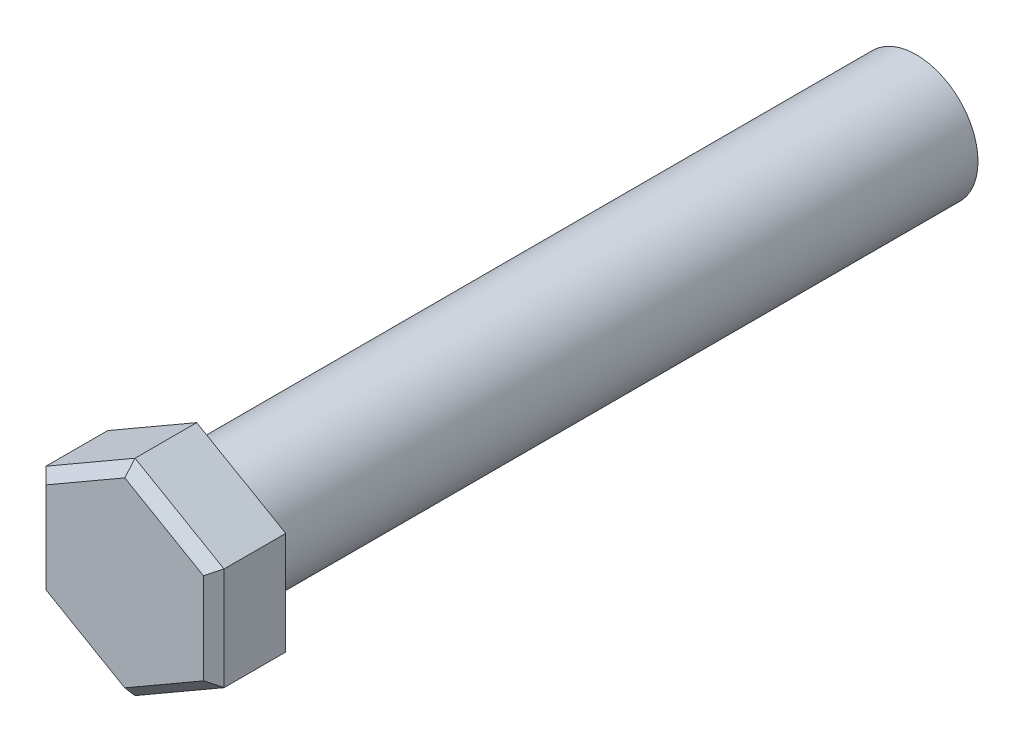
ISO-10303-21;
HEADER;
FILE_DESCRIPTION(('STEP AP214'),'2;1');
FILE_NAME('part.step','',(''),(''),'','','');
FILE_SCHEMA(('AUTOMOTIVE_DESIGN { 1 0 10303 214 1 1 1 1 }'));
ENDSEC;
DATA;
#1=APPLICATION_CONTEXT('core data for automotive mechanical design processes');
#2=APPLICATION_PROTOCOL_DEFINITION('international standard','automotive_design',2000,#1);
#3=PRODUCT_CONTEXT('',#1,'mechanical');
#4=PRODUCT('Part','Part','',(#3));
#5=PRODUCT_RELATED_PRODUCT_CATEGORY('part','',(#4));
#6=PRODUCT_DEFINITION_FORMATION('','',#4);
#7=PRODUCT_DEFINITION_CONTEXT('part definition',#1,'design');
#8=PRODUCT_DEFINITION('design','',#6,#7);
#9=PRODUCT_DEFINITION_SHAPE('','',#8);
#10=(LENGTH_UNIT() NAMED_UNIT(*) SI_UNIT(.MILLI.,.METRE.));
#11=(NAMED_UNIT(*) PLANE_ANGLE_UNIT() SI_UNIT($,.RADIAN.));
#12=(NAMED_UNIT(*) SI_UNIT($,.STERADIAN.) SOLID_ANGLE_UNIT());
#13=UNCERTAINTY_MEASURE_WITH_UNIT(LENGTH_MEASURE(1.E-05),#10,'distance_accuracy_value','');
#14=(GEOMETRIC_REPRESENTATION_CONTEXT(3) GLOBAL_UNCERTAINTY_ASSIGNED_CONTEXT((#13)) GLOBAL_UNIT_ASSIGNED_CONTEXT((#10,
#11,#12)) REPRESENTATION_CONTEXT('',''));
#15=CARTESIAN_POINT('',(0.,0.,0.));
#16=DIRECTION('',(0.,0.,1.));
#17=DIRECTION('',(1.,0.,0.));
#18=AXIS2_PLACEMENT_3D('',#15,#16,#17);
#19=CARTESIAN_POINT('',(0.,0.,70.));
#20=DIRECTION('',(0.,0.,-1.));
#21=DIRECTION('',(-1.,0.,0.));
#22=AXIS2_PLACEMENT_3D('',#19,#20,#21);
#23=CYLINDRICAL_SURFACE('',#22,6.);
#24=CARTESIAN_POINT('',(0.,0.,69.));
#25=DIRECTION('',(0.,0.,1.));
#26=DIRECTION('',(1.,0.,0.));
#27=AXIS2_PLACEMENT_3D('',#24,#25,#26);
#28=CIRCLE('',#27,6.);
#29=CARTESIAN_POINT('',(6.,0.,69.));
#30=VERTEX_POINT('',#29);
#31=EDGE_CURVE('E11',#30,#30,#28,.F.);
#32=ORIENTED_EDGE('',*,*,#31,.T.);
#33=EDGE_LOOP('',(#32));
#34=FACE_BOUND('',#33,.T.);
#35=CARTESIAN_POINT('',(0.,0.,0.));
#36=DIRECTION('',(0.,0.,1.));
#37=DIRECTION('',(1.,0.,0.));
#38=AXIS2_PLACEMENT_3D('',#35,#36,#37);
#39=CIRCLE('',#38,6.);
#40=CARTESIAN_POINT('',(6.,0.,0.));
#41=VERTEX_POINT('',#40);
#42=EDGE_CURVE('E128',#41,#41,#39,.T.);
#43=ORIENTED_EDGE('',*,*,#42,.T.);
#44=EDGE_LOOP('',(#43));
#45=FACE_BOUND('',#44,.T.);
#46=ADVANCED_FACE('F43',(#34,#45),#23,.T.);
#47=CARTESIAN_POINT('',(0.,0.,0.));
#48=DIRECTION('',(0.,0.,1.));
#49=DIRECTION('',(1.,0.,0.));
#50=AXIS2_PLACEMENT_3D('',#47,#48,#49);
#51=PLANE('',#50);
#52=ORIENTED_EDGE('',*,*,#42,.F.);
#53=EDGE_LOOP('',(#52));
#54=FACE_BOUND('',#53,.T.);
#55=ADVANCED_FACE('F248',(#54),#51,.F.);
#56=CARTESIAN_POINT('',(8.66025403784437,0.,77.));
#57=DIRECTION('',(-1.,0.,0.));
#58=DIRECTION('',(0.,-1.,0.));
#59=AXIS2_PLACEMENT_3D('',#56,#57,#58);
#60=PLANE('',#59);
#61=DIRECTION('',(0.,0.,-1.));
#62=VECTOR('',#61,1.);
#63=CARTESIAN_POINT('',(8.66025403784436,5.00000000000004,77.));
#64=LINE('',#63,#62);
#65=CARTESIAN_POINT('',(8.66025403784436,5.00000000000004,76.));
#66=VERTEX_POINT('',#65);
#67=CARTESIAN_POINT('',(8.66025403784436,5.00000000000004,70.));
#68=VERTEX_POINT('',#67);
#69=EDGE_CURVE('E116',#66,#68,#64,.T.);
#70=ORIENTED_EDGE('',*,*,#69,.F.);
#71=DIRECTION('',(0.,-1.,0.));
#72=VECTOR('',#71,1.);
#73=CARTESIAN_POINT('',(8.66025403784438,-5.00000000000001,76.));
#74=LINE('',#73,#72);
#75=CARTESIAN_POINT('',(8.66025403784438,-5.00000000000001,76.));
#76=VERTEX_POINT('',#75);
#77=EDGE_CURVE('E201',#66,#76,#74,.T.);
#78=ORIENTED_EDGE('',*,*,#77,.T.);
#79=DIRECTION('',(0.,0.,-1.));
#80=VECTOR('',#79,1.);
#81=CARTESIAN_POINT('',(8.66025403784438,-5.00000000000001,77.));
#82=LINE('',#81,#80);
#83=CARTESIAN_POINT('',(8.66025403784438,-5.00000000000001,70.));
#84=VERTEX_POINT('',#83);
#85=EDGE_CURVE('E143',#76,#84,#82,.T.);
#86=ORIENTED_EDGE('',*,*,#85,.T.);
#87=DIRECTION('',(0.,1.,0.));
#88=VECTOR('',#87,1.);
#89=CARTESIAN_POINT('',(8.66025403784437,0.,70.));
#90=LINE('',#89,#88);
#91=EDGE_CURVE('E135',#84,#68,#90,.T.);
#92=ORIENTED_EDGE('',*,*,#91,.T.);
#93=EDGE_LOOP('',(#70,#78,#86,#92));
#94=FACE_BOUND('',#93,.T.);
#95=ADVANCED_FACE('F141',(#94),#60,.F.);
#96=CARTESIAN_POINT('',(4.33012701892218,7.50000000000002,77.));
#97=DIRECTION('',(-0.499999999999998,-0.86602540378444,0.));
#98=DIRECTION('',(0.86602540378444,-0.499999999999998,0.));
#99=AXIS2_PLACEMENT_3D('',#96,#97,#98);
#100=PLANE('',#99);
#101=DIRECTION('',(0.,0.,-1.));
#102=VECTOR('',#101,1.);
#103=CARTESIAN_POINT('',(0.,10.,77.));
#104=LINE('',#103,#102);
#105=CARTESIAN_POINT('',(0.,10.,76.));
#106=VERTEX_POINT('',#105);
#107=CARTESIAN_POINT('',(0.,10.,70.));
#108=VERTEX_POINT('',#107);
#109=EDGE_CURVE('E129',#106,#108,#104,.T.);
#110=ORIENTED_EDGE('',*,*,#109,.F.);
#111=DIRECTION('',(0.86602540378444,-0.499999999999998,0.));
#112=VECTOR('',#111,1.);
#113=CARTESIAN_POINT('',(8.66025403784436,5.00000000000004,76.));
#114=LINE('',#113,#112);
#115=EDGE_CURVE('E122',#106,#66,#114,.T.);
#116=ORIENTED_EDGE('',*,*,#115,.T.);
#117=ORIENTED_EDGE('',*,*,#69,.T.);
#118=DIRECTION('',(-0.86602540378444,0.499999999999998,0.));
#119=VECTOR('',#118,1.);
#120=CARTESIAN_POINT('',(4.33012701892218,7.50000000000002,70.));
#121=LINE('',#120,#119);
#122=EDGE_CURVE('E119',#68,#108,#121,.T.);
#123=ORIENTED_EDGE('',*,*,#122,.T.);
#124=EDGE_LOOP('',(#110,#116,#117,#123));
#125=FACE_BOUND('',#124,.T.);
#126=ADVANCED_FACE('F118',(#125),#100,.F.);
#127=CARTESIAN_POINT('',(-4.33012701892218,7.50000000000002,77.));
#128=DIRECTION('',(0.499999999999998,-0.86602540378444,0.));
#129=DIRECTION('',(0.86602540378444,0.499999999999998,0.));
#130=AXIS2_PLACEMENT_3D('',#127,#128,#129);
#131=PLANE('',#130);
#132=DIRECTION('',(0.,0.,-1.));
#133=VECTOR('',#132,1.);
#134=CARTESIAN_POINT('',(-8.66025403784437,5.00000000000004,77.));
#135=LINE('',#134,#133);
#136=CARTESIAN_POINT('',(-8.66025403784437,5.00000000000004,76.));
#137=VERTEX_POINT('',#136);
#138=CARTESIAN_POINT('',(-8.66025403784437,5.00000000000004,70.));
#139=VERTEX_POINT('',#138);
#140=EDGE_CURVE('E174',#137,#139,#135,.T.);
#141=ORIENTED_EDGE('',*,*,#140,.F.);
#142=DIRECTION('',(0.86602540378444,0.499999999999998,0.));
#143=VECTOR('',#142,1.);
#144=CARTESIAN_POINT('',(0.,10.,76.));
#145=LINE('',#144,#143);
#146=EDGE_CURVE('E59',#137,#106,#145,.T.);
#147=ORIENTED_EDGE('',*,*,#146,.T.);
#148=ORIENTED_EDGE('',*,*,#109,.T.);
#149=DIRECTION('',(-0.86602540378444,-0.499999999999998,0.));
#150=VECTOR('',#149,1.);
#151=CARTESIAN_POINT('',(-4.33012701892218,7.50000000000002,70.));
#152=LINE('',#151,#150);
#153=EDGE_CURVE('E138',#108,#139,#152,.T.);
#154=ORIENTED_EDGE('',*,*,#153,.T.);
#155=EDGE_LOOP('',(#141,#147,#148,#154));
#156=FACE_BOUND('',#155,.T.);
#157=ADVANCED_FACE('F317',(#156),#131,.F.);
#158=CARTESIAN_POINT('',(-8.66025403784436,0.,77.));
#159=DIRECTION('',(1.,0.,0.));
#160=DIRECTION('',(0.,1.,0.));
#161=AXIS2_PLACEMENT_3D('',#158,#159,#160);
#162=PLANE('',#161);
#163=DIRECTION('',(0.,0.,-1.));
#164=VECTOR('',#163,1.);
#165=CARTESIAN_POINT('',(-8.66025403784436,-5.00000000000004,77.));
#166=LINE('',#165,#164);
#167=CARTESIAN_POINT('',(-8.66025403784436,-5.00000000000004,76.));
#168=VERTEX_POINT('',#167);
#169=CARTESIAN_POINT('',(-8.66025403784436,-5.00000000000004,70.));
#170=VERTEX_POINT('',#169);
#171=EDGE_CURVE('E171',#168,#170,#166,.T.);
#172=ORIENTED_EDGE('',*,*,#171,.F.);
#173=DIRECTION('',(0.,1.,0.));
#174=VECTOR('',#173,1.);
#175=CARTESIAN_POINT('',(-8.66025403784437,5.00000000000004,76.));
#176=LINE('',#175,#174);
#177=EDGE_CURVE('E67',#168,#137,#176,.T.);
#178=ORIENTED_EDGE('',*,*,#177,.T.);
#179=ORIENTED_EDGE('',*,*,#140,.T.);
#180=DIRECTION('',(0.,-1.,0.));
#181=VECTOR('',#180,1.);
#182=CARTESIAN_POINT('',(-8.66025403784436,0.,70.));
#183=LINE('',#182,#181);
#184=EDGE_CURVE('E155',#139,#170,#183,.T.);
#185=ORIENTED_EDGE('',*,*,#184,.T.);
#186=EDGE_LOOP('',(#172,#178,#179,#185));
#187=FACE_BOUND('',#186,.T.);
#188=ADVANCED_FACE('F316',(#187),#162,.F.);
#189=CARTESIAN_POINT('',(-4.33012701892218,-7.50000000000002,77.));
#190=DIRECTION('',(0.499999999999998,0.86602540378444,0.));
#191=DIRECTION('',(-0.86602540378444,0.499999999999998,0.));
#192=AXIS2_PLACEMENT_3D('',#189,#190,#191);
#193=PLANE('',#192);
#194=DIRECTION('',(0.,0.,-1.));
#195=VECTOR('',#194,1.);
#196=CARTESIAN_POINT('',(0.,-10.,77.));
#197=LINE('',#196,#195);
#198=CARTESIAN_POINT('',(0.,-10.,76.));
#199=VERTEX_POINT('',#198);
#200=CARTESIAN_POINT('',(0.,-10.,70.));
#201=VERTEX_POINT('',#200);
#202=EDGE_CURVE('E168',#199,#201,#197,.T.);
#203=ORIENTED_EDGE('',*,*,#202,.F.);
#204=DIRECTION('',(-0.86602540378444,0.499999999999998,0.));
#205=VECTOR('',#204,1.);
#206=CARTESIAN_POINT('',(-8.66025403784436,-5.00000000000004,76.));
#207=LINE('',#206,#205);
#208=EDGE_CURVE('E207',#199,#168,#207,.T.);
#209=ORIENTED_EDGE('',*,*,#208,.T.);
#210=ORIENTED_EDGE('',*,*,#171,.T.);
#211=DIRECTION('',(0.86602540378444,-0.499999999999998,0.));
#212=VECTOR('',#211,1.);
#213=CARTESIAN_POINT('',(-4.33012701892218,-7.50000000000002,70.));
#214=LINE('',#213,#212);
#215=EDGE_CURVE('E159',#170,#201,#214,.T.);
#216=ORIENTED_EDGE('',*,*,#215,.T.);
#217=EDGE_LOOP('',(#203,#209,#210,#216));
#218=FACE_BOUND('',#217,.T.);
#219=ADVANCED_FACE('F314',(#218),#193,.F.);
#220=CARTESIAN_POINT('',(4.33012701892219,-7.50000000000001,77.));
#221=DIRECTION('',(-0.5,0.866025403784439,0.));
#222=DIRECTION('',(-0.866025403784439,-0.5,0.));
#223=AXIS2_PLACEMENT_3D('',#220,#221,#222);
#224=PLANE('',#223);
#225=ORIENTED_EDGE('',*,*,#85,.F.);
#226=DIRECTION('',(-0.866025403784439,-0.5,0.));
#227=VECTOR('',#226,1.);
#228=CARTESIAN_POINT('',(0.,-10.,76.));
#229=LINE('',#228,#227);
#230=EDGE_CURVE('E204',#76,#199,#229,.T.);
#231=ORIENTED_EDGE('',*,*,#230,.T.);
#232=ORIENTED_EDGE('',*,*,#202,.T.);
#233=DIRECTION('',(0.866025403784439,0.5,0.));
#234=VECTOR('',#233,1.);
#235=CARTESIAN_POINT('',(4.33012701892219,-7.50000000000001,70.));
#236=LINE('',#235,#234);
#237=EDGE_CURVE('E163',#201,#84,#236,.T.);
#238=ORIENTED_EDGE('',*,*,#237,.T.);
#239=EDGE_LOOP('',(#225,#231,#232,#238));
#240=FACE_BOUND('',#239,.T.);
#241=ADVANCED_FACE('F310',(#240),#224,.F.);
#242=CARTESIAN_POINT('',(0.,0.,77.));
#243=DIRECTION('',(0.,0.,1.));
#244=DIRECTION('',(1.,0.,0.));
#245=AXIS2_PLACEMENT_3D('',#242,#243,#244);
#246=PLANE('',#245);
#247=DIRECTION('',(0.866025403784439,0.5,0.));
#248=VECTOR('',#247,1.);
#249=CARTESIAN_POINT('',(8.16025403784437,-4.13397459621556,77.));
#250=LINE('',#249,#248);
#251=CARTESIAN_POINT('',(0.,-8.84529946162074,77.));
#252=VERTEX_POINT('',#251);
#253=CARTESIAN_POINT('',(7.66025403784437,-4.42264973081038,77.));
#254=VERTEX_POINT('',#253);
#255=EDGE_CURVE('E194',#252,#254,#250,.T.);
#256=ORIENTED_EDGE('',*,*,#255,.T.);
#257=DIRECTION('',(0.,1.,0.));
#258=VECTOR('',#257,1.);
#259=CARTESIAN_POINT('',(7.66025403784435,5.00000000000004,77.));
#260=LINE('',#259,#258);
#261=CARTESIAN_POINT('',(7.66025403784435,4.42264973081041,77.));
#262=VERTEX_POINT('',#261);
#263=EDGE_CURVE('E197',#254,#262,#260,.T.);
#264=ORIENTED_EDGE('',*,*,#263,.T.);
#265=DIRECTION('',(-0.86602540378444,0.499999999999998,0.));
#266=VECTOR('',#265,1.);
#267=CARTESIAN_POINT('',(-0.500000000000004,9.13397459621555,77.));
#268=LINE('',#267,#266);
#269=CARTESIAN_POINT('',(0.,8.84529946162074,77.));
#270=VERTEX_POINT('',#269);
#271=EDGE_CURVE('E182',#262,#270,#268,.T.);
#272=ORIENTED_EDGE('',*,*,#271,.T.);
#273=DIRECTION('',(-0.86602540378444,-0.499999999999998,0.));
#274=VECTOR('',#273,1.);
#275=CARTESIAN_POINT('',(-8.16025403784436,4.13397459621559,77.));
#276=LINE('',#275,#274);
#277=CARTESIAN_POINT('',(-7.66025403784435,4.42264973081041,77.));
#278=VERTEX_POINT('',#277);
#279=EDGE_CURVE('E185',#270,#278,#276,.T.);
#280=ORIENTED_EDGE('',*,*,#279,.T.);
#281=DIRECTION('',(0.,-1.,0.));
#282=VECTOR('',#281,1.);
#283=CARTESIAN_POINT('',(-7.66025403784435,-5.00000000000004,77.));
#284=LINE('',#283,#282);
#285=CARTESIAN_POINT('',(-7.66025403784435,-4.4226497308104,77.));
#286=VERTEX_POINT('',#285);
#287=EDGE_CURVE('E188',#278,#286,#284,.T.);
#288=ORIENTED_EDGE('',*,*,#287,.T.);
#289=DIRECTION('',(0.86602540378444,-0.499999999999998,0.));
#290=VECTOR('',#289,1.);
#291=CARTESIAN_POINT('',(0.500000000000004,-9.13397459621555,77.));
#292=LINE('',#291,#290);
#293=EDGE_CURVE('E191',#286,#252,#292,.T.);
#294=ORIENTED_EDGE('',*,*,#293,.T.);
#295=EDGE_LOOP('',(#256,#264,#272,#280,#288,#294));
#296=FACE_BOUND('',#295,.T.);
#297=ADVANCED_FACE('F297',(#296),#246,.T.);
#298=CARTESIAN_POINT('',(0.,0.,70.));
#299=DIRECTION('',(0.,0.,1.));
#300=DIRECTION('',(1.,0.,0.));
#301=AXIS2_PLACEMENT_3D('',#298,#299,#300);
#302=PLANE('',#301);
#303=CARTESIAN_POINT('',(0.,0.,70.));
#304=DIRECTION('',(0.,0.,1.));
#305=DIRECTION('',(1.,0.,0.));
#306=AXIS2_PLACEMENT_3D('',#303,#304,#305);
#307=CIRCLE('',#306,7.);
#308=CARTESIAN_POINT('',(7.,0.,70.));
#309=VERTEX_POINT('',#308);
#310=EDGE_CURVE('E52',#309,#309,#307,.T.);
#311=ORIENTED_EDGE('',*,*,#310,.T.);
#312=EDGE_LOOP('',(#311));
#313=FACE_BOUND('',#312,.T.);
#314=ORIENTED_EDGE('',*,*,#91,.F.);
#315=ORIENTED_EDGE('',*,*,#237,.F.);
#316=ORIENTED_EDGE('',*,*,#215,.F.);
#317=ORIENTED_EDGE('',*,*,#184,.F.);
#318=ORIENTED_EDGE('',*,*,#153,.F.);
#319=ORIENTED_EDGE('',*,*,#122,.F.);
#320=EDGE_LOOP('',(#314,#315,#316,#317,#318,#319));
#321=FACE_BOUND('',#320,.T.);
#322=ADVANCED_FACE('F133',(#313,#321),#302,.F.);
#323=CARTESIAN_POINT('',(-7.66025403784435,0.,77.));
#324=DIRECTION('',(-0.707106781186554,0.,0.707106781186541));
#325=DIRECTION('',(0.,1.,0.));
#326=AXIS2_PLACEMENT_3D('',#323,#324,#325);
#327=PLANE('',#326);
#328=DIRECTION('',(0.654653670707972,-0.377964473009226,0.654653670707983));
#329=VECTOR('',#328,1.);
#330=CARTESIAN_POINT('',(-6.56593203243803,3.79084262640894,78.0943220054064));
#331=LINE('',#330,#329);
#332=EDGE_CURVE('E150',#137,#278,#331,.T.);
#333=ORIENTED_EDGE('',*,*,#332,.F.);
#334=ORIENTED_EDGE('',*,*,#177,.F.);
#335=DIRECTION('',(0.654653670707972,0.377964473009225,0.654653670707984));
#336=VECTOR('',#335,1.);
#337=CARTESIAN_POINT('',(-6.56593203243802,-3.79084262640893,78.0943220054064));
#338=LINE('',#337,#336);
#339=EDGE_CURVE('E146',#286,#168,#338,.F.);
#340=ORIENTED_EDGE('',*,*,#339,.F.);
#341=ORIENTED_EDGE('',*,*,#287,.F.);
#342=EDGE_LOOP('',(#333,#334,#340,#341));
#343=FACE_BOUND('',#342,.T.);
#344=ADVANCED_FACE('F288',(#343),#327,.T.);
#345=CARTESIAN_POINT('',(-3.83012701892218,-6.63397459621557,77.));
#346=DIRECTION('',(-0.353553390593276,-0.612372435695801,0.707106781186541));
#347=DIRECTION('',(-0.86602540378444,0.499999999999998,0.));
#348=AXIS2_PLACEMENT_3D('',#345,#346,#347);
#349=PLANE('',#348);
#350=ORIENTED_EDGE('',*,*,#339,.T.);
#351=ORIENTED_EDGE('',*,*,#208,.F.);
#352=DIRECTION('',(0.,0.755928946018449,0.654653670707984));
#353=VECTOR('',#352,1.);
#354=CARTESIAN_POINT('',(0.,-7.5816852528178,78.0943220054064));
#355=LINE('',#354,#353);
#356=EDGE_CURVE('E226',#252,#199,#355,.F.);
#357=ORIENTED_EDGE('',*,*,#356,.F.);
#358=ORIENTED_EDGE('',*,*,#293,.F.);
#359=EDGE_LOOP('',(#350,#351,#357,#358));
#360=FACE_BOUND('',#359,.T.);
#361=ADVANCED_FACE('F282',(#360),#349,.T.);
#362=CARTESIAN_POINT('',(-3.83012701892218,6.63397459621557,77.));
#363=DIRECTION('',(-0.353553390593275,0.6123724356958,0.707106781186542));
#364=DIRECTION('',(0.86602540378444,0.499999999999998,0.));
#365=AXIS2_PLACEMENT_3D('',#362,#363,#364);
#366=PLANE('',#365);
#367=ORIENTED_EDGE('',*,*,#332,.T.);
#368=ORIENTED_EDGE('',*,*,#279,.F.);
#369=DIRECTION('',(0.,-0.755928946018449,0.654653670707984));
#370=VECTOR('',#369,1.);
#371=CARTESIAN_POINT('',(0.,7.58168525281781,78.0943220054064));
#372=LINE('',#371,#370);
#373=EDGE_CURVE('E222',#106,#270,#372,.T.);
#374=ORIENTED_EDGE('',*,*,#373,.F.);
#375=ORIENTED_EDGE('',*,*,#146,.F.);
#376=EDGE_LOOP('',(#367,#368,#374,#375));
#377=FACE_BOUND('',#376,.T.);
#378=ADVANCED_FACE('F275',(#377),#366,.T.);
#379=CARTESIAN_POINT('',(3.83012701892219,-6.63397459621556,77.));
#380=DIRECTION('',(0.353553390593277,-0.6123724356958,0.707106781186541));
#381=DIRECTION('',(-0.866025403784439,-0.5,0.));
#382=AXIS2_PLACEMENT_3D('',#379,#380,#381);
#383=PLANE('',#382);
#384=ORIENTED_EDGE('',*,*,#356,.T.);
#385=ORIENTED_EDGE('',*,*,#230,.F.);
#386=DIRECTION('',(-0.654653670707973,0.377964473009224,0.654653670707983));
#387=VECTOR('',#386,1.);
#388=CARTESIAN_POINT('',(6.56593203243804,-3.79084262640891,78.0943220054064));
#389=LINE('',#388,#387);
#390=EDGE_CURVE('E219',#254,#76,#389,.F.);
#391=ORIENTED_EDGE('',*,*,#390,.F.);
#392=ORIENTED_EDGE('',*,*,#255,.F.);
#393=EDGE_LOOP('',(#384,#385,#391,#392));
#394=FACE_BOUND('',#393,.T.);
#395=ADVANCED_FACE('F268',(#394),#383,.T.);
#396=CARTESIAN_POINT('',(3.83012701892218,6.63397459621557,77.));
#397=DIRECTION('',(0.353553390593276,0.612372435695801,0.707106781186541));
#398=DIRECTION('',(0.86602540378444,-0.499999999999998,0.));
#399=AXIS2_PLACEMENT_3D('',#396,#397,#398);
#400=PLANE('',#399);
#401=ORIENTED_EDGE('',*,*,#373,.T.);
#402=ORIENTED_EDGE('',*,*,#271,.F.);
#403=DIRECTION('',(0.654653670707971,0.377964473009226,-0.654653670707984));
#404=VECTOR('',#403,1.);
#405=CARTESIAN_POINT('',(6.56593203243803,3.79084262640894,78.0943220054064));
#406=LINE('',#405,#404);
#407=EDGE_CURVE('E216',#66,#262,#406,.F.);
#408=ORIENTED_EDGE('',*,*,#407,.F.);
#409=ORIENTED_EDGE('',*,*,#115,.F.);
#410=EDGE_LOOP('',(#401,#402,#408,#409));
#411=FACE_BOUND('',#410,.T.);
#412=ADVANCED_FACE('F243',(#411),#400,.T.);
#413=CARTESIAN_POINT('',(7.66025403784436,0.,77.));
#414=DIRECTION('',(0.707106781186554,0.,0.707106781186541));
#415=DIRECTION('',(0.,-1.,0.));
#416=AXIS2_PLACEMENT_3D('',#413,#414,#415);
#417=PLANE('',#416);
#418=ORIENTED_EDGE('',*,*,#390,.T.);
#419=ORIENTED_EDGE('',*,*,#77,.F.);
#420=ORIENTED_EDGE('',*,*,#407,.T.);
#421=ORIENTED_EDGE('',*,*,#263,.F.);
#422=EDGE_LOOP('',(#418,#419,#420,#421));
#423=FACE_BOUND('',#422,.T.);
#424=ADVANCED_FACE('F238',(#423),#417,.T.);
#425=CARTESIAN_POINT('',(0.,0.,69.));
#426=DIRECTION('',(0.,0.,1.));
#427=DIRECTION('',(1.,0.,0.));
#428=AXIS2_PLACEMENT_3D('',#425,#426,#427);
#429=TOROIDAL_SURFACE('',#428,7.,1.);
#430=ORIENTED_EDGE('',*,*,#31,.F.);
#431=EDGE_LOOP('',(#430));
#432=FACE_BOUND('',#431,.T.);
#433=ORIENTED_EDGE('',*,*,#310,.F.);
#434=EDGE_LOOP('',(#433));
#435=FACE_BOUND('',#434,.T.);
#436=ADVANCED_FACE('F45',(#432,#435),#429,.F.);
#437=CLOSED_SHELL('',(#46,#55,#95,#126,#157,#188,#219,#241,#297,#322,#344,#361,#378,#395,#412,
#424,#436));
#438=MANIFOLD_SOLID_BREP('B2',#437);
#439=ADVANCED_BREP_SHAPE_REPRESENTATION('',(#18,#438),#14);
#440=SHAPE_DEFINITION_REPRESENTATION(#9,#439);
ENDSEC;
END-ISO-10303-21;
